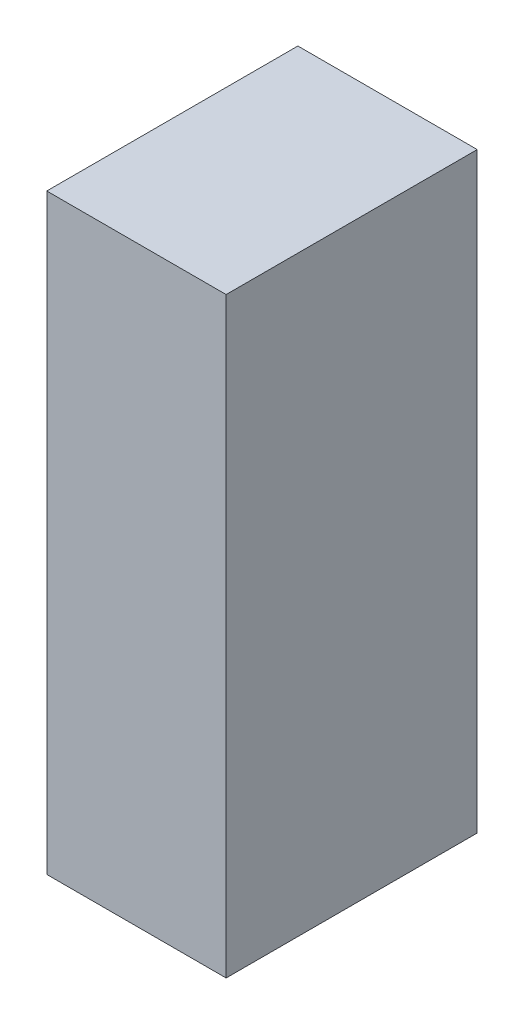
ISO-10303-21;
HEADER;
FILE_DESCRIPTION(('STEP AP214'),'2;1');
FILE_NAME('part.step','',(''),(''),'','','');
FILE_SCHEMA(('AUTOMOTIVE_DESIGN { 1 0 10303 214 1 1 1 1 }'));
ENDSEC;
DATA;
#1=APPLICATION_CONTEXT('core data for automotive mechanical design processes');
#2=APPLICATION_PROTOCOL_DEFINITION('international standard','automotive_design',2000,#1);
#3=PRODUCT_CONTEXT('',#1,'mechanical');
#4=PRODUCT('Part','Part','',(#3));
#5=PRODUCT_RELATED_PRODUCT_CATEGORY('part','',(#4));
#6=PRODUCT_DEFINITION_FORMATION('','',#4);
#7=PRODUCT_DEFINITION_CONTEXT('part definition',#1,'design');
#8=PRODUCT_DEFINITION('design','',#6,#7);
#9=PRODUCT_DEFINITION_SHAPE('','',#8);
#10=(LENGTH_UNIT() NAMED_UNIT(*) SI_UNIT(.MILLI.,.METRE.));
#11=(NAMED_UNIT(*) PLANE_ANGLE_UNIT() SI_UNIT($,.RADIAN.));
#12=(NAMED_UNIT(*) SI_UNIT($,.STERADIAN.) SOLID_ANGLE_UNIT());
#13=UNCERTAINTY_MEASURE_WITH_UNIT(LENGTH_MEASURE(1.E-05),#10,'distance_accuracy_value','');
#14=(GEOMETRIC_REPRESENTATION_CONTEXT(3) GLOBAL_UNCERTAINTY_ASSIGNED_CONTEXT((#13)) GLOBAL_UNIT_ASSIGNED_CONTEXT((#10,
#11,#12)) REPRESENTATION_CONTEXT('',''));
#15=CARTESIAN_POINT('',(0.,0.,0.));
#16=DIRECTION('',(0.,0.,1.));
#17=DIRECTION('',(1.,0.,0.));
#18=AXIS2_PLACEMENT_3D('',#15,#16,#17);
#19=CARTESIAN_POINT('',(1.12499037303387,-0.825011098017285,-2.84112203121185));
#20=DIRECTION('',(-1.19248806385031E-08,-1.,0.));
#21=DIRECTION('',(1.,-1.19248806385031E-08,0.));
#22=AXIS2_PLACEMENT_3D('',#19,#20,#21);
#23=PLANE('',#22);
#24=DIRECTION('',(1.,-1.19248805337978E-08,0.));
#25=VECTOR('',#24,1.);
#26=CARTESIAN_POINT('',(1.12499037303387,-0.825011098017285,-2.84112203121185));
#27=LINE('',#26,#25);
#28=CARTESIAN_POINT('',(1.12499037303387,-0.825011098017285,-2.84112203121185));
#29=VERTEX_POINT('',#28);
#30=CARTESIAN_POINT('',(1.6249980024284,-0.825011103979819,-2.84112203121185));
#31=VERTEX_POINT('',#30);
#32=EDGE_CURVE('E11',#29,#31,#27,.T.);
#33=ORIENTED_EDGE('',*,*,#32,.T.);
#34=DIRECTION('',(0.,0.,1.));
#35=VECTOR('',#34,1.);
#36=CARTESIAN_POINT('',(1.6249980024284,-0.825011103979816,-2.84112203121185));
#37=LINE('',#36,#35);
#38=CARTESIAN_POINT('',(1.6249980024284,-0.825011103979819,-2.14112091064453));
#39=VERTEX_POINT('',#38);
#40=EDGE_CURVE('E88',#31,#39,#37,.T.);
#41=ORIENTED_EDGE('',*,*,#40,.T.);
#42=DIRECTION('',(1.,-1.19248805337978E-08,0.));
#43=VECTOR('',#42,1.);
#44=CARTESIAN_POINT('',(1.12499037303387,-0.825011098017285,-2.14112091064453));
#45=LINE('',#44,#43);
#46=CARTESIAN_POINT('',(1.12499037303387,-0.825011098017285,-2.14112091064453));
#47=VERTEX_POINT('',#46);
#48=EDGE_CURVE('E83',#47,#39,#45,.T.);
#49=ORIENTED_EDGE('',*,*,#48,.F.);
#50=DIRECTION('',(0.,0.,1.));
#51=VECTOR('',#50,1.);
#52=CARTESIAN_POINT('',(1.12499037303387,-0.825011098017284,-2.84112203121185));
#53=LINE('',#52,#51);
#54=EDGE_CURVE('E72',#29,#47,#53,.T.);
#55=ORIENTED_EDGE('',*,*,#54,.F.);
#56=EDGE_LOOP('',(#33,#41,#49,#55));
#57=FACE_BOUND('',#56,.T.);
#58=ADVANCED_FACE('F17',(#57),#23,.T.);
#59=CARTESIAN_POINT('',(1.6249980024284,-0.825011103979819,-2.84112203121185));
#60=DIRECTION('',(1.,-1.19248806385031E-08,0.));
#61=DIRECTION('',(1.19248806385031E-08,1.,0.));
#62=AXIS2_PLACEMENT_3D('',#59,#60,#61);
#63=PLANE('',#62);
#64=DIRECTION('',(1.19248805831428E-08,1.,0.));
#65=VECTOR('',#64,1.);
#66=CARTESIAN_POINT('',(1.6249980024284,-0.825011103979819,-2.84112203121185));
#67=LINE('',#66,#65);
#68=CARTESIAN_POINT('',(1.62499802210438,0.824982792504557,-2.84112203121185));
#69=VERTEX_POINT('',#68);
#70=EDGE_CURVE('E24',#31,#69,#67,.T.);
#71=ORIENTED_EDGE('',*,*,#70,.T.);
#72=DIRECTION('',(0.,0.,1.));
#73=VECTOR('',#72,1.);
#74=CARTESIAN_POINT('',(1.62499802210438,0.824982792504556,-2.84112203121185));
#75=LINE('',#74,#73);
#76=CARTESIAN_POINT('',(1.62499802210438,0.824982792504557,-2.14112091064453));
#77=VERTEX_POINT('',#76);
#78=EDGE_CURVE('E85',#69,#77,#75,.T.);
#79=ORIENTED_EDGE('',*,*,#78,.T.);
#80=DIRECTION('',(1.19248805831428E-08,1.,0.));
#81=VECTOR('',#80,1.);
#82=CARTESIAN_POINT('',(1.6249980024284,-0.825011103979819,-2.14112091064453));
#83=LINE('',#82,#81);
#84=EDGE_CURVE('E66',#39,#77,#83,.T.);
#85=ORIENTED_EDGE('',*,*,#84,.F.);
#86=ORIENTED_EDGE('',*,*,#40,.F.);
#87=EDGE_LOOP('',(#71,#79,#85,#86));
#88=FACE_BOUND('',#87,.T.);
#89=ADVANCED_FACE('F89',(#88),#63,.T.);
#90=CARTESIAN_POINT('',(1.62499802210438,0.824982792504557,-2.84112203121185));
#91=DIRECTION('',(1.19248806385031E-08,1.,0.));
#92=DIRECTION('',(-1.,1.19248806385031E-08,0.));
#93=AXIS2_PLACEMENT_3D('',#90,#91,#92);
#94=PLANE('',#93);
#95=DIRECTION('',(-1.,1.19248805337978E-08,0.));
#96=VECTOR('',#95,1.);
#97=CARTESIAN_POINT('',(1.62499802210438,0.824982792504557,-2.84112203121185));
#98=LINE('',#97,#96);
#99=CARTESIAN_POINT('',(1.12499039270985,0.82498279846709,-2.84112203121185));
#100=VERTEX_POINT('',#99);
#101=EDGE_CURVE('E62',#69,#100,#98,.T.);
#102=ORIENTED_EDGE('',*,*,#101,.T.);
#103=DIRECTION('',(0.,0.,1.));
#104=VECTOR('',#103,1.);
#105=CARTESIAN_POINT('',(1.12499039270985,0.824982798467088,-2.84112203121185));
#106=LINE('',#105,#104);
#107=CARTESIAN_POINT('',(1.12499039270985,0.82498279846709,-2.14112091064453));
#108=VERTEX_POINT('',#107);
#109=EDGE_CURVE('E55',#100,#108,#106,.T.);
#110=ORIENTED_EDGE('',*,*,#109,.T.);
#111=DIRECTION('',(-1.,1.19248805337978E-08,0.));
#112=VECTOR('',#111,1.);
#113=CARTESIAN_POINT('',(1.62499802210438,0.824982792504557,-2.14112091064453));
#114=LINE('',#113,#112);
#115=EDGE_CURVE('E59',#77,#108,#114,.T.);
#116=ORIENTED_EDGE('',*,*,#115,.F.);
#117=ORIENTED_EDGE('',*,*,#78,.F.);
#118=EDGE_LOOP('',(#102,#110,#116,#117));
#119=FACE_BOUND('',#118,.T.);
#120=ADVANCED_FACE('F57',(#119),#94,.T.);
#121=CARTESIAN_POINT('',(1.12499039270985,0.82498279846709,-2.84112203121185));
#122=DIRECTION('',(-1.,1.19248806385031E-08,0.));
#123=DIRECTION('',(-1.19248806385031E-08,-1.,0.));
#124=AXIS2_PLACEMENT_3D('',#121,#122,#123);
#125=PLANE('',#124);
#126=DIRECTION('',(-1.19248805831428E-08,-1.,0.));
#127=VECTOR('',#126,1.);
#128=CARTESIAN_POINT('',(1.12499039270985,0.82498279846709,-2.84112203121185));
#129=LINE('',#128,#127);
#130=EDGE_CURVE('E65',#100,#29,#129,.T.);
#131=ORIENTED_EDGE('',*,*,#130,.T.);
#132=ORIENTED_EDGE('',*,*,#54,.T.);
#133=DIRECTION('',(-1.19248805831428E-08,-1.,0.));
#134=VECTOR('',#133,1.);
#135=CARTESIAN_POINT('',(1.12499039270985,0.82498279846709,-2.14112091064453));
#136=LINE('',#135,#134);
#137=EDGE_CURVE('E70',#108,#47,#136,.T.);
#138=ORIENTED_EDGE('',*,*,#137,.F.);
#139=ORIENTED_EDGE('',*,*,#109,.F.);
#140=EDGE_LOOP('',(#131,#132,#138,#139));
#141=FACE_BOUND('',#140,.T.);
#142=ADVANCED_FACE('F71',(#141),#125,.T.);
#143=CARTESIAN_POINT('',(94.1249923706055,-473.100006103516,-2.14112091064453));
#144=DIRECTION('',(0.,0.,1.));
#145=DIRECTION('',(1.19248806385031E-08,1.,0.));
#146=AXIS2_PLACEMENT_3D('',#143,#144,#145);
#147=PLANE('',#146);
#148=ORIENTED_EDGE('',*,*,#48,.T.);
#149=ORIENTED_EDGE('',*,*,#84,.T.);
#150=ORIENTED_EDGE('',*,*,#115,.T.);
#151=ORIENTED_EDGE('',*,*,#137,.T.);
#152=EDGE_LOOP('',(#148,#149,#150,#151));
#153=FACE_BOUND('',#152,.T.);
#154=ADVANCED_FACE('F76',(#153),#147,.T.);
#155=CARTESIAN_POINT('',(94.1249923706055,-473.100006103516,-2.84112203121185));
#156=DIRECTION('',(0.,0.,1.));
#157=DIRECTION('',(1.19248806385031E-08,1.,0.));
#158=AXIS2_PLACEMENT_3D('',#155,#156,#157);
#159=PLANE('',#158);
#160=ORIENTED_EDGE('',*,*,#130,.F.);
#161=ORIENTED_EDGE('',*,*,#101,.F.);
#162=ORIENTED_EDGE('',*,*,#70,.F.);
#163=ORIENTED_EDGE('',*,*,#32,.F.);
#164=EDGE_LOOP('',(#160,#161,#162,#163));
#165=FACE_BOUND('',#164,.T.);
#166=ADVANCED_FACE('F91',(#165),#159,.F.);
#167=CLOSED_SHELL('',(#58,#89,#120,#142,#154,#166));
#168=MANIFOLD_SOLID_BREP('B1',#167);
#169=ADVANCED_BREP_SHAPE_REPRESENTATION('',(#18,#168),#14);
#170=SHAPE_DEFINITION_REPRESENTATION(#9,#169);
ENDSEC;
END-ISO-10303-21;
